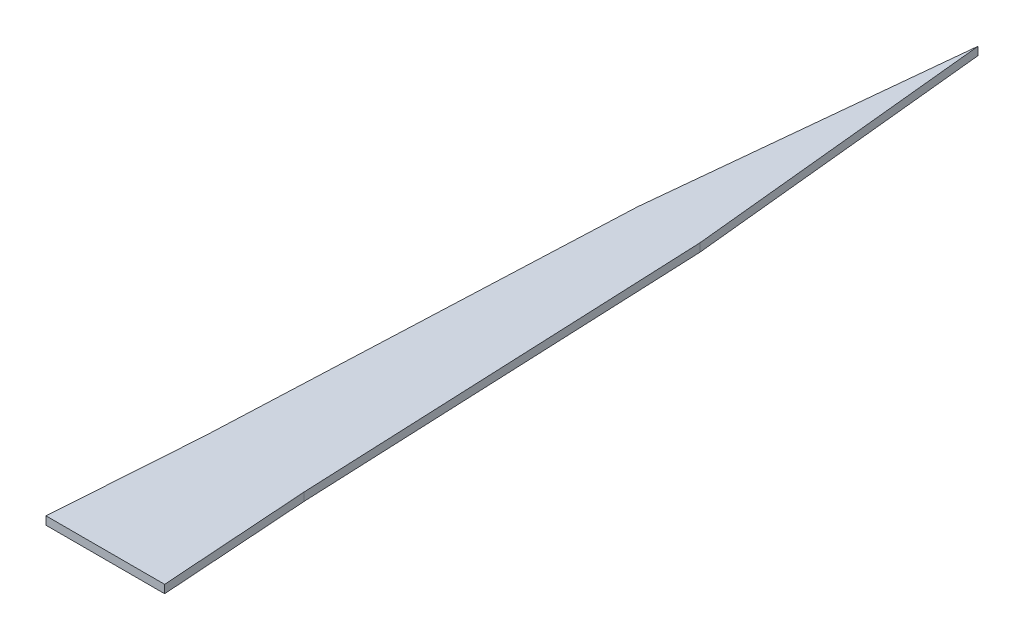
ISO-10303-21;
HEADER;
FILE_DESCRIPTION(('STEP AP214'),'2;1');
FILE_NAME('part.step','',(''),(''),'','','');
FILE_SCHEMA(('AUTOMOTIVE_DESIGN { 1 0 10303 214 1 1 1 1 }'));
ENDSEC;
DATA;
#1=APPLICATION_CONTEXT('core data for automotive mechanical design processes');
#2=APPLICATION_PROTOCOL_DEFINITION('international standard','automotive_design',2000,#1);
#3=PRODUCT_CONTEXT('',#1,'mechanical');
#4=PRODUCT('Part','Part','',(#3));
#5=PRODUCT_RELATED_PRODUCT_CATEGORY('part','',(#4));
#6=PRODUCT_DEFINITION_FORMATION('','',#4);
#7=PRODUCT_DEFINITION_CONTEXT('part definition',#1,'design');
#8=PRODUCT_DEFINITION('design','',#6,#7);
#9=PRODUCT_DEFINITION_SHAPE('','',#8);
#10=(LENGTH_UNIT() NAMED_UNIT(*) SI_UNIT(.MILLI.,.METRE.));
#11=(NAMED_UNIT(*) PLANE_ANGLE_UNIT() SI_UNIT($,.RADIAN.));
#12=(NAMED_UNIT(*) SI_UNIT($,.STERADIAN.) SOLID_ANGLE_UNIT());
#13=UNCERTAINTY_MEASURE_WITH_UNIT(LENGTH_MEASURE(1.E-05),#10,'distance_accuracy_value','');
#14=(GEOMETRIC_REPRESENTATION_CONTEXT(3) GLOBAL_UNCERTAINTY_ASSIGNED_CONTEXT((#13)) GLOBAL_UNIT_ASSIGNED_CONTEXT((#10,
#11,#12)) REPRESENTATION_CONTEXT('',''));
#15=CARTESIAN_POINT('',(0.,0.,0.));
#16=DIRECTION('',(0.,0.,1.));
#17=DIRECTION('',(1.,0.,0.));
#18=AXIS2_PLACEMENT_3D('',#15,#16,#17);
#19=CARTESIAN_POINT('',(26.5439734173554,2.,-36.5776855642009));
#20=DIRECTION('',(-0.999067406582521,0.,0.0431777385289512));
#21=DIRECTION('',(0.0431777385289512,0.,0.999067406582522));
#22=AXIS2_PLACEMENT_3D('',#19,#20,#21);
#23=PLANE('',#22);
#24=DIRECTION('',(-0.0431777385289512,0.,-0.999067406582522));
#25=VECTOR('',#24,1.);
#26=CARTESIAN_POINT('',(26.5439734173554,0.,-36.5776855642009));
#27=LINE('',#26,#25);
#28=CARTESIAN_POINT('',(26.5439734173554,0.,-36.5776855642009));
#29=VERTEX_POINT('',#28);
#30=CARTESIAN_POINT('',(22.1621744214095,0.,-137.965870962337));
#31=VERTEX_POINT('',#30);
#32=EDGE_CURVE('E134',#29,#31,#27,.T.);
#33=ORIENTED_EDGE('',*,*,#32,.T.);
#34=DIRECTION('',(0.,-1.,0.));
#35=VECTOR('',#34,1.);
#36=CARTESIAN_POINT('',(22.1621744214095,2.,-137.965870962337));
#37=LINE('',#36,#35);
#38=CARTESIAN_POINT('',(22.1621744214095,2.,-137.965870962337));
#39=VERTEX_POINT('',#38);
#40=EDGE_CURVE('E11',#39,#31,#37,.T.);
#41=ORIENTED_EDGE('',*,*,#40,.F.);
#42=DIRECTION('',(-0.0431777385289512,0.,-0.999067406582522));
#43=VECTOR('',#42,1.);
#44=CARTESIAN_POINT('',(26.5439734173554,2.,-36.5776855642009));
#45=LINE('',#44,#43);
#46=CARTESIAN_POINT('',(26.5439734173554,2.,-36.5776855642009));
#47=VERTEX_POINT('',#46);
#48=EDGE_CURVE('E153',#47,#39,#45,.T.);
#49=ORIENTED_EDGE('',*,*,#48,.F.);
#50=DIRECTION('',(0.,-1.,0.));
#51=VECTOR('',#50,1.);
#52=CARTESIAN_POINT('',(26.5439734173554,2.,-36.5776855642009));
#53=LINE('',#52,#51);
#54=EDGE_CURVE('E130',#47,#29,#53,.T.);
#55=ORIENTED_EDGE('',*,*,#54,.T.);
#56=EDGE_LOOP('',(#33,#41,#49,#55));
#57=FACE_BOUND('',#56,.T.);
#58=ADVANCED_FACE('F39',(#57),#23,.F.);
#59=CARTESIAN_POINT('',(22.1621744214095,2.,-137.965870962337));
#60=DIRECTION('',(-0.994948951822211,0.,0.100382186008697));
#61=DIRECTION('',(0.100382186008697,0.,0.994948951822211));
#62=AXIS2_PLACEMENT_3D('',#59,#60,#61);
#63=PLANE('',#62);
#64=DIRECTION('',(-0.100382186008697,0.,-0.994948951822211));
#65=VECTOR('',#64,1.);
#66=CARTESIAN_POINT('',(22.1621744214095,0.,-137.965870962337));
#67=LINE('',#66,#65);
#68=CARTESIAN_POINT('',(14.5254544820801,0.,-213.658051030395));
#69=VERTEX_POINT('',#68);
#70=EDGE_CURVE('E138',#31,#69,#67,.T.);
#71=ORIENTED_EDGE('',*,*,#70,.T.);
#72=DIRECTION('',(0.,-1.,0.));
#73=VECTOR('',#72,1.);
#74=CARTESIAN_POINT('',(14.5254544820801,2.,-213.658051030395));
#75=LINE('',#74,#73);
#76=CARTESIAN_POINT('',(14.5254544820801,2.,-213.658051030395));
#77=VERTEX_POINT('',#76);
#78=EDGE_CURVE('E48',#77,#69,#75,.T.);
#79=ORIENTED_EDGE('',*,*,#78,.F.);
#80=DIRECTION('',(-0.100382186008697,0.,-0.994948951822211));
#81=VECTOR('',#80,1.);
#82=CARTESIAN_POINT('',(22.1621744214095,2.,-137.965870962337));
#83=LINE('',#82,#81);
#84=EDGE_CURVE('E96',#39,#77,#83,.T.);
#85=ORIENTED_EDGE('',*,*,#84,.F.);
#86=ORIENTED_EDGE('',*,*,#40,.T.);
#87=EDGE_LOOP('',(#71,#79,#85,#86));
#88=FACE_BOUND('',#87,.T.);
#89=ADVANCED_FACE('F187',(#88),#63,.F.);
#90=CARTESIAN_POINT('',(14.5254544820801,2.,-213.658051030395));
#91=DIRECTION('',(0.994948951822211,0.,0.100382186008697));
#92=DIRECTION('',(0.100382186008697,0.,-0.994948951822211));
#93=AXIS2_PLACEMENT_3D('',#90,#91,#92);
#94=PLANE('',#93);
#95=DIRECTION('',(-0.100382186008697,0.,0.994948951822211));
#96=VECTOR('',#95,1.);
#97=CARTESIAN_POINT('',(14.5254544820801,0.,-213.658051030395));
#98=LINE('',#97,#96);
#99=CARTESIAN_POINT('',(6.88873454275066,0.,-137.965870962337));
#100=VERTEX_POINT('',#99);
#101=EDGE_CURVE('E141',#69,#100,#98,.T.);
#102=ORIENTED_EDGE('',*,*,#101,.T.);
#103=DIRECTION('',(0.,-1.,0.));
#104=VECTOR('',#103,1.);
#105=CARTESIAN_POINT('',(6.88873454275066,2.,-137.965870962337));
#106=LINE('',#105,#104);
#107=CARTESIAN_POINT('',(6.88873454275066,2.,-137.965870962337));
#108=VERTEX_POINT('',#107);
#109=EDGE_CURVE('E160',#108,#100,#106,.T.);
#110=ORIENTED_EDGE('',*,*,#109,.F.);
#111=DIRECTION('',(-0.100382186008697,0.,0.994948951822211));
#112=VECTOR('',#111,1.);
#113=CARTESIAN_POINT('',(14.5254544820801,2.,-213.658051030395));
#114=LINE('',#113,#112);
#115=EDGE_CURVE('E170',#77,#108,#114,.T.);
#116=ORIENTED_EDGE('',*,*,#115,.F.);
#117=ORIENTED_EDGE('',*,*,#78,.T.);
#118=EDGE_LOOP('',(#102,#110,#116,#117));
#119=FACE_BOUND('',#118,.T.);
#120=ADVANCED_FACE('F168',(#119),#94,.F.);
#121=CARTESIAN_POINT('',(6.88873454275066,2.,-137.965870962337));
#122=DIRECTION('',(0.999067406582521,0.,0.0431777385289512));
#123=DIRECTION('',(0.0431777385289512,0.,-0.999067406582522));
#124=AXIS2_PLACEMENT_3D('',#121,#122,#123);
#125=PLANE('',#124);
#126=DIRECTION('',(-0.0431777385289512,0.,0.999067406582522));
#127=VECTOR('',#126,1.);
#128=CARTESIAN_POINT('',(6.88873454275066,0.,-137.965870962337));
#129=LINE('',#128,#127);
#130=CARTESIAN_POINT('',(2.50693554680478,0.,-36.5776855642009));
#131=VERTEX_POINT('',#130);
#132=EDGE_CURVE('E144',#100,#131,#129,.T.);
#133=ORIENTED_EDGE('',*,*,#132,.T.);
#134=DIRECTION('',(0.,-1.,0.));
#135=VECTOR('',#134,1.);
#136=CARTESIAN_POINT('',(2.50693554680478,2.,-36.5776855642009));
#137=LINE('',#136,#135);
#138=CARTESIAN_POINT('',(2.50693554680478,2.,-36.5776855642009));
#139=VERTEX_POINT('',#138);
#140=EDGE_CURVE('E123',#139,#131,#137,.T.);
#141=ORIENTED_EDGE('',*,*,#140,.F.);
#142=DIRECTION('',(-0.0431777385289512,0.,0.999067406582522));
#143=VECTOR('',#142,1.);
#144=CARTESIAN_POINT('',(6.88873454275066,2.,-137.965870962337));
#145=LINE('',#144,#143);
#146=EDGE_CURVE('E112',#108,#139,#145,.T.);
#147=ORIENTED_EDGE('',*,*,#146,.F.);
#148=ORIENTED_EDGE('',*,*,#109,.T.);
#149=EDGE_LOOP('',(#133,#141,#147,#148));
#150=FACE_BOUND('',#149,.T.);
#151=ADVANCED_FACE('F176',(#150),#125,.F.);
#152=CARTESIAN_POINT('',(2.50693554680478,2.,-36.5776855642009));
#153=DIRECTION('',(0.997659561936225,0.,0.0683768855478226));
#154=DIRECTION('',(0.0683768855478226,0.,-0.997659561936225));
#155=AXIS2_PLACEMENT_3D('',#152,#153,#154);
#156=PLANE('',#155);
#157=DIRECTION('',(-0.0683768855478226,0.,0.997659561936225));
#158=VECTOR('',#157,1.);
#159=CARTESIAN_POINT('',(2.50693554680478,0.,-36.5776855642009));
#160=LINE('',#159,#158);
#161=CARTESIAN_POINT('',(0.,0.,0.));
#162=VERTEX_POINT('',#161);
#163=EDGE_CURVE('E121',#131,#162,#160,.T.);
#164=ORIENTED_EDGE('',*,*,#163,.T.);
#165=DIRECTION('',(0.,-1.,0.));
#166=VECTOR('',#165,1.);
#167=CARTESIAN_POINT('',(0.,2.,0.));
#168=LINE('',#167,#166);
#169=CARTESIAN_POINT('',(0.,2.,0.));
#170=VERTEX_POINT('',#169);
#171=EDGE_CURVE('E118',#170,#162,#168,.T.);
#172=ORIENTED_EDGE('',*,*,#171,.F.);
#173=DIRECTION('',(-0.0683768855478226,0.,0.997659561936225));
#174=VECTOR('',#173,1.);
#175=CARTESIAN_POINT('',(2.50693554680478,2.,-36.5776855642009));
#176=LINE('',#175,#174);
#177=EDGE_CURVE('E106',#139,#170,#176,.T.);
#178=ORIENTED_EDGE('',*,*,#177,.F.);
#179=ORIENTED_EDGE('',*,*,#140,.T.);
#180=EDGE_LOOP('',(#164,#172,#178,#179));
#181=FACE_BOUND('',#180,.T.);
#182=ADVANCED_FACE('F119',(#181),#156,.F.);
#183=CARTESIAN_POINT('',(0.,2.,0.));
#184=DIRECTION('',(0.,0.,-1.));
#185=DIRECTION('',(-1.,0.,0.));
#186=AXIS2_PLACEMENT_3D('',#183,#184,#185);
#187=PLANE('',#186);
#188=DIRECTION('',(1.,0.,0.));
#189=VECTOR('',#188,1.);
#190=CARTESIAN_POINT('',(0.,0.,0.));
#191=LINE('',#190,#189);
#192=CARTESIAN_POINT('',(29.0509089641602,0.,0.));
#193=VERTEX_POINT('',#192);
#194=EDGE_CURVE('E82',#162,#193,#191,.T.);
#195=ORIENTED_EDGE('',*,*,#194,.T.);
#196=DIRECTION('',(0.,-1.,0.));
#197=VECTOR('',#196,1.);
#198=CARTESIAN_POINT('',(29.0509089641602,2.,0.));
#199=LINE('',#198,#197);
#200=CARTESIAN_POINT('',(29.0509089641602,2.,0.));
#201=VERTEX_POINT('',#200);
#202=EDGE_CURVE('E124',#201,#193,#199,.T.);
#203=ORIENTED_EDGE('',*,*,#202,.F.);
#204=DIRECTION('',(1.,0.,0.));
#205=VECTOR('',#204,1.);
#206=CARTESIAN_POINT('',(0.,2.,0.));
#207=LINE('',#206,#205);
#208=EDGE_CURVE('E110',#170,#201,#207,.T.);
#209=ORIENTED_EDGE('',*,*,#208,.F.);
#210=ORIENTED_EDGE('',*,*,#171,.T.);
#211=EDGE_LOOP('',(#195,#203,#209,#210));
#212=FACE_BOUND('',#211,.T.);
#213=ADVANCED_FACE('F126',(#212),#187,.F.);
#214=CARTESIAN_POINT('',(29.0509089641602,2.,0.));
#215=DIRECTION('',(-0.997659561936225,0.,0.0683768855478226));
#216=DIRECTION('',(0.0683768855478226,0.,0.997659561936225));
#217=AXIS2_PLACEMENT_3D('',#214,#215,#216);
#218=PLANE('',#217);
#219=DIRECTION('',(-0.0683768855478226,0.,-0.997659561936225));
#220=VECTOR('',#219,1.);
#221=CARTESIAN_POINT('',(29.0509089641602,0.,0.));
#222=LINE('',#221,#220);
#223=EDGE_CURVE('E88',#193,#29,#222,.T.);
#224=ORIENTED_EDGE('',*,*,#223,.T.);
#225=ORIENTED_EDGE('',*,*,#54,.F.);
#226=DIRECTION('',(-0.0683768855478226,0.,-0.997659561936225));
#227=VECTOR('',#226,1.);
#228=CARTESIAN_POINT('',(29.0509089641602,2.,0.));
#229=LINE('',#228,#227);
#230=EDGE_CURVE('E56',#201,#47,#229,.T.);
#231=ORIENTED_EDGE('',*,*,#230,.F.);
#232=ORIENTED_EDGE('',*,*,#202,.T.);
#233=EDGE_LOOP('',(#224,#225,#231,#232));
#234=FACE_BOUND('',#233,.T.);
#235=ADVANCED_FACE('F201',(#234),#218,.F.);
#236=CARTESIAN_POINT('',(0.,2.,0.));
#237=DIRECTION('',(0.,-1.,0.));
#238=DIRECTION('',(0.,0.,-1.));
#239=AXIS2_PLACEMENT_3D('',#236,#237,#238);
#240=PLANE('',#239);
#241=ORIENTED_EDGE('',*,*,#48,.T.);
#242=ORIENTED_EDGE('',*,*,#84,.T.);
#243=ORIENTED_EDGE('',*,*,#115,.T.);
#244=ORIENTED_EDGE('',*,*,#146,.T.);
#245=ORIENTED_EDGE('',*,*,#177,.T.);
#246=ORIENTED_EDGE('',*,*,#208,.T.);
#247=ORIENTED_EDGE('',*,*,#230,.T.);
#248=EDGE_LOOP('',(#241,#242,#243,#244,#245,#246,#247));
#249=FACE_BOUND('',#248,.T.);
#250=ADVANCED_FACE('F108',(#249),#240,.F.);
#251=CARTESIAN_POINT('',(0.,0.,0.));
#252=DIRECTION('',(0.,-1.,0.));
#253=DIRECTION('',(0.,0.,-1.));
#254=AXIS2_PLACEMENT_3D('',#251,#252,#253);
#255=PLANE('',#254);
#256=ORIENTED_EDGE('',*,*,#32,.F.);
#257=ORIENTED_EDGE('',*,*,#223,.F.);
#258=ORIENTED_EDGE('',*,*,#194,.F.);
#259=ORIENTED_EDGE('',*,*,#163,.F.);
#260=ORIENTED_EDGE('',*,*,#132,.F.);
#261=ORIENTED_EDGE('',*,*,#101,.F.);
#262=ORIENTED_EDGE('',*,*,#70,.F.);
#263=EDGE_LOOP('',(#256,#257,#258,#259,#260,#261,#262));
#264=FACE_BOUND('',#263,.T.);
#265=ADVANCED_FACE('F174',(#264),#255,.T.);
#266=CLOSED_SHELL('',(#58,#89,#120,#151,#182,#213,#235,#250,#265));
#267=MANIFOLD_SOLID_BREP('B2',#266);
#268=ADVANCED_BREP_SHAPE_REPRESENTATION('',(#18,#267),#14);
#269=SHAPE_DEFINITION_REPRESENTATION(#9,#268);
ENDSEC;
END-ISO-10303-21;
